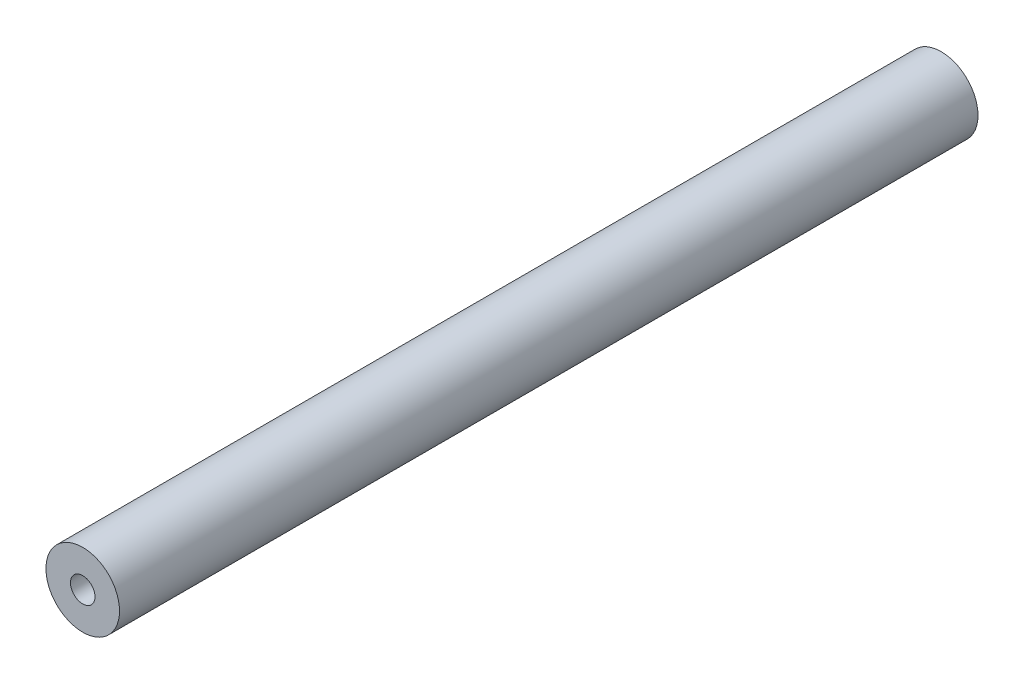
ISO-10303-21;
HEADER;
FILE_DESCRIPTION(('STEP AP214'),'2;1');
FILE_NAME('part.step','',(''),(''),'','','');
FILE_SCHEMA(('AUTOMOTIVE_DESIGN { 1 0 10303 214 1 1 1 1 }'));
ENDSEC;
DATA;
#1=APPLICATION_CONTEXT('core data for automotive mechanical design processes');
#2=APPLICATION_PROTOCOL_DEFINITION('international standard','automotive_design',2000,#1);
#3=PRODUCT_CONTEXT('',#1,'mechanical');
#4=PRODUCT('Part','Part','',(#3));
#5=PRODUCT_RELATED_PRODUCT_CATEGORY('part','',(#4));
#6=PRODUCT_DEFINITION_FORMATION('','',#4);
#7=PRODUCT_DEFINITION_CONTEXT('part definition',#1,'design');
#8=PRODUCT_DEFINITION('design','',#6,#7);
#9=PRODUCT_DEFINITION_SHAPE('','',#8);
#10=(LENGTH_UNIT() NAMED_UNIT(*) SI_UNIT(.MILLI.,.METRE.));
#11=(NAMED_UNIT(*) PLANE_ANGLE_UNIT() SI_UNIT($,.RADIAN.));
#12=(NAMED_UNIT(*) SI_UNIT($,.STERADIAN.) SOLID_ANGLE_UNIT());
#13=UNCERTAINTY_MEASURE_WITH_UNIT(LENGTH_MEASURE(1.E-05),#10,'distance_accuracy_value','');
#14=(GEOMETRIC_REPRESENTATION_CONTEXT(3) GLOBAL_UNCERTAINTY_ASSIGNED_CONTEXT((#13)) GLOBAL_UNIT_ASSIGNED_CONTEXT((#10,
#11,#12)) REPRESENTATION_CONTEXT('',''));
#15=CARTESIAN_POINT('',(0.,0.,0.));
#16=DIRECTION('',(0.,0.,1.));
#17=DIRECTION('',(1.,0.,0.));
#18=AXIS2_PLACEMENT_3D('',#15,#16,#17);
#19=CARTESIAN_POINT('',(0.,0.,70.));
#20=DIRECTION('',(0.,0.,1.));
#21=DIRECTION('',(1.,0.,0.));
#22=AXIS2_PLACEMENT_3D('',#19,#20,#21);
#23=PLANE('',#22);
#24=CARTESIAN_POINT('',(0.,0.,70.));
#25=DIRECTION('',(0.,0.,1.));
#26=DIRECTION('',(1.,0.,0.));
#27=AXIS2_PLACEMENT_3D('',#24,#25,#26);
#28=CIRCLE('',#27,3.);
#29=CARTESIAN_POINT('',(3.,0.,70.));
#30=VERTEX_POINT('',#29);
#31=EDGE_CURVE('E11',#30,#30,#28,.T.);
#32=ORIENTED_EDGE('',*,*,#31,.T.);
#33=EDGE_LOOP('',(#32));
#34=FACE_BOUND('',#33,.T.);
#35=CARTESIAN_POINT('',(0.,0.,70.));
#36=DIRECTION('',(0.,0.,1.));
#37=DIRECTION('',(1.,0.,0.));
#38=AXIS2_PLACEMENT_3D('',#35,#36,#37);
#39=CIRCLE('',#38,1.);
#40=CARTESIAN_POINT('',(1.,0.,70.));
#41=VERTEX_POINT('',#40);
#42=EDGE_CURVE('E50',#41,#41,#39,.T.);
#43=ORIENTED_EDGE('',*,*,#42,.F.);
#44=EDGE_LOOP('',(#43));
#45=FACE_BOUND('',#44,.T.);
#46=ADVANCED_FACE('F39',(#34,#45),#23,.T.);
#47=CARTESIAN_POINT('',(0.,0.,0.));
#48=DIRECTION('',(0.,0.,1.));
#49=DIRECTION('',(1.,0.,0.));
#50=AXIS2_PLACEMENT_3D('',#47,#48,#49);
#51=PLANE('',#50);
#52=CARTESIAN_POINT('',(0.,0.,0.));
#53=DIRECTION('',(0.,0.,1.));
#54=DIRECTION('',(1.,0.,0.));
#55=AXIS2_PLACEMENT_3D('',#52,#53,#54);
#56=CIRCLE('',#55,3.);
#57=CARTESIAN_POINT('',(3.,0.,0.));
#58=VERTEX_POINT('',#57);
#59=EDGE_CURVE('E43',#58,#58,#56,.T.);
#60=ORIENTED_EDGE('',*,*,#59,.F.);
#61=EDGE_LOOP('',(#60));
#62=FACE_BOUND('',#61,.T.);
#63=CARTESIAN_POINT('',(0.,0.,0.));
#64=DIRECTION('',(0.,0.,1.));
#65=DIRECTION('',(1.,0.,0.));
#66=AXIS2_PLACEMENT_3D('',#63,#64,#65);
#67=CIRCLE('',#66,1.);
#68=CARTESIAN_POINT('',(1.,0.,0.));
#69=VERTEX_POINT('',#68);
#70=EDGE_CURVE('E52',#69,#69,#67,.T.);
#71=ORIENTED_EDGE('',*,*,#70,.T.);
#72=EDGE_LOOP('',(#71));
#73=FACE_BOUND('',#72,.T.);
#74=ADVANCED_FACE('F62',(#62,#73),#51,.F.);
#75=CARTESIAN_POINT('',(0.,0.,70.));
#76=DIRECTION('',(0.,0.,-1.));
#77=DIRECTION('',(-1.,0.,0.));
#78=AXIS2_PLACEMENT_3D('',#75,#76,#77);
#79=CYLINDRICAL_SURFACE('',#78,3.);
#80=ORIENTED_EDGE('',*,*,#31,.F.);
#81=EDGE_LOOP('',(#80));
#82=FACE_BOUND('',#81,.T.);
#83=ORIENTED_EDGE('',*,*,#59,.T.);
#84=EDGE_LOOP('',(#83));
#85=FACE_BOUND('',#84,.T.);
#86=ADVANCED_FACE('F41',(#82,#85),#79,.T.);
#87=CARTESIAN_POINT('',(0.,0.,70.));
#88=DIRECTION('',(0.,0.,-1.));
#89=DIRECTION('',(-1.,0.,0.));
#90=AXIS2_PLACEMENT_3D('',#87,#88,#89);
#91=CYLINDRICAL_SURFACE('',#90,1.);
#92=ORIENTED_EDGE('',*,*,#42,.T.);
#93=EDGE_LOOP('',(#92));
#94=FACE_BOUND('',#93,.T.);
#95=ORIENTED_EDGE('',*,*,#70,.F.);
#96=EDGE_LOOP('',(#95));
#97=FACE_BOUND('',#96,.T.);
#98=ADVANCED_FACE('F58',(#94,#97),#91,.F.);
#99=CLOSED_SHELL('',(#46,#74,#86,#98));
#100=MANIFOLD_SOLID_BREP('B2',#99);
#101=ADVANCED_BREP_SHAPE_REPRESENTATION('',(#18,#100),#14);
#102=SHAPE_DEFINITION_REPRESENTATION(#9,#101);
ENDSEC;
END-ISO-10303-21;
